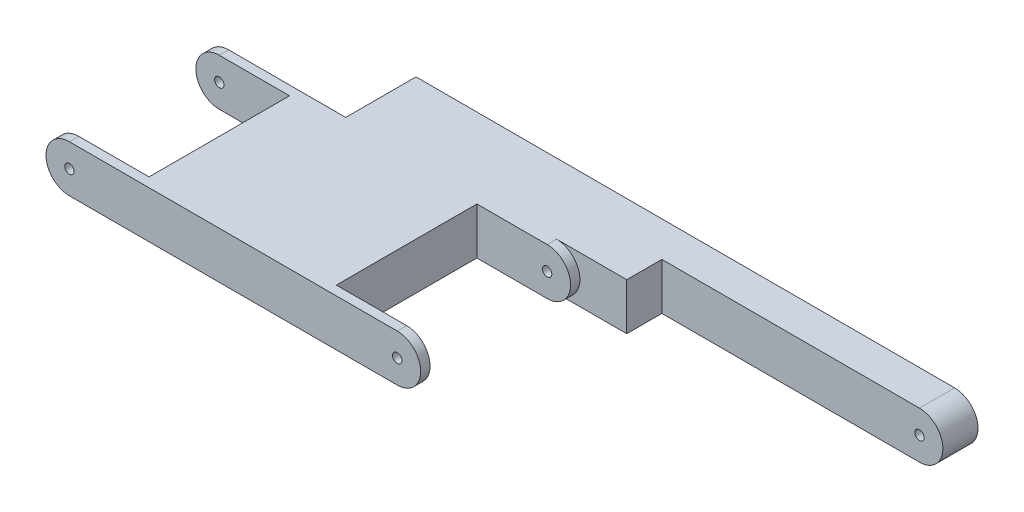
ISO-10303-21;
HEADER;
FILE_DESCRIPTION(('STEP AP214'),'2;1');
FILE_NAME('part.step','',(''),(''),'','','');
FILE_SCHEMA(('AUTOMOTIVE_DESIGN { 1 0 10303 214 1 1 1 1 }'));
ENDSEC;
DATA;
#1=APPLICATION_CONTEXT('core data for automotive mechanical design processes');
#2=APPLICATION_PROTOCOL_DEFINITION('international standard','automotive_design',2000,#1);
#3=PRODUCT_CONTEXT('',#1,'mechanical');
#4=PRODUCT('Part','Part','',(#3));
#5=PRODUCT_RELATED_PRODUCT_CATEGORY('part','',(#4));
#6=PRODUCT_DEFINITION_FORMATION('','',#4);
#7=PRODUCT_DEFINITION_CONTEXT('part definition',#1,'design');
#8=PRODUCT_DEFINITION('design','',#6,#7);
#9=PRODUCT_DEFINITION_SHAPE('','',#8);
#10=(LENGTH_UNIT() NAMED_UNIT(*) SI_UNIT(.MILLI.,.METRE.));
#11=(NAMED_UNIT(*) PLANE_ANGLE_UNIT() SI_UNIT($,.RADIAN.));
#12=(NAMED_UNIT(*) SI_UNIT($,.STERADIAN.) SOLID_ANGLE_UNIT());
#13=UNCERTAINTY_MEASURE_WITH_UNIT(LENGTH_MEASURE(1.E-05),#10,'distance_accuracy_value','');
#14=(GEOMETRIC_REPRESENTATION_CONTEXT(3) GLOBAL_UNCERTAINTY_ASSIGNED_CONTEXT((#13)) GLOBAL_UNIT_ASSIGNED_CONTEXT((#10,
#11,#12)) REPRESENTATION_CONTEXT('',''));
#15=CARTESIAN_POINT('',(0.,0.,0.));
#16=DIRECTION('',(0.,0.,1.));
#17=DIRECTION('',(1.,0.,0.));
#18=AXIS2_PLACEMENT_3D('',#15,#16,#17);
#19=CARTESIAN_POINT('',(105.,0.,0.));
#20=DIRECTION('',(0.,0.,1.));
#21=DIRECTION('',(1.,0.,0.));
#22=AXIS2_PLACEMENT_3D('',#19,#20,#21);
#23=PLANE('',#22);
#24=DIRECTION('',(1.,0.,0.));
#25=VECTOR('',#24,1.);
#26=CARTESIAN_POINT('',(0.,-5.,0.));
#27=LINE('',#26,#25);
#28=CARTESIAN_POINT('',(35.,-5.,0.));
#29=VERTEX_POINT('',#28);
#30=CARTESIAN_POINT('',(50.,-5.,0.));
#31=VERTEX_POINT('',#30);
#32=EDGE_CURVE('E183',#29,#31,#27,.T.);
#33=ORIENTED_EDGE('',*,*,#32,.T.);
#34=DIRECTION('',(0.,1.,0.));
#35=VECTOR('',#34,1.);
#36=CARTESIAN_POINT('',(50.,0.,0.));
#37=LINE('',#36,#35);
#38=CARTESIAN_POINT('',(50.,5.,0.));
#39=VERTEX_POINT('',#38);
#40=EDGE_CURVE('E314',#31,#39,#37,.T.);
#41=ORIENTED_EDGE('',*,*,#40,.T.);
#42=DIRECTION('',(-1.,0.,0.));
#43=VECTOR('',#42,1.);
#44=CARTESIAN_POINT('',(0.,5.,0.));
#45=LINE('',#44,#43);
#46=CARTESIAN_POINT('',(35.,5.,0.));
#47=VERTEX_POINT('',#46);
#48=EDGE_CURVE('E176',#39,#47,#45,.T.);
#49=ORIENTED_EDGE('',*,*,#48,.T.);
#50=CARTESIAN_POINT('',(35.,0.,0.));
#51=DIRECTION('',(0.,0.,1.));
#52=DIRECTION('',(1.,0.,0.));
#53=AXIS2_PLACEMENT_3D('',#50,#51,#52);
#54=CIRCLE('',#53,5.);
#55=EDGE_CURVE('E278',#29,#47,#54,.T.);
#56=ORIENTED_EDGE('',*,*,#55,.F.);
#57=EDGE_LOOP('',(#33,#41,#49,#56));
#58=FACE_BOUND('',#57,.T.);
#59=ADVANCED_FACE('F33',(#58),#23,.T.);
#60=CARTESIAN_POINT('',(-35.,-5.,34.));
#61=DIRECTION('',(0.,1.,0.));
#62=DIRECTION('',(0.,0.,1.));
#63=AXIS2_PLACEMENT_3D('',#60,#61,#62);
#64=PLANE('',#63);
#65=DIRECTION('',(0.,0.,-1.));
#66=VECTOR('',#65,1.);
#67=CARTESIAN_POINT('',(50.,-5.,34.));
#68=LINE('',#67,#66);
#69=CARTESIAN_POINT('',(50.,-5.,-7.5));
#70=VERTEX_POINT('',#69);
#71=EDGE_CURVE('E170',#31,#70,#68,.T.);
#72=ORIENTED_EDGE('',*,*,#71,.F.);
#73=ORIENTED_EDGE('',*,*,#32,.F.);
#74=DIRECTION('',(0.,0.,-1.));
#75=VECTOR('',#74,1.);
#76=CARTESIAN_POINT('',(35.,-5.,34.));
#77=LINE('',#76,#75);
#78=CARTESIAN_POINT('',(35.,-5.,2.));
#79=VERTEX_POINT('',#78);
#80=EDGE_CURVE('E289',#79,#29,#77,.T.);
#81=ORIENTED_EDGE('',*,*,#80,.F.);
#82=DIRECTION('',(1.,0.,0.));
#83=VECTOR('',#82,1.);
#84=CARTESIAN_POINT('',(-35.,-5.,2.));
#85=LINE('',#84,#83);
#86=CARTESIAN_POINT('',(20.,-5.,2.));
#87=VERTEX_POINT('',#86);
#88=EDGE_CURVE('E221',#87,#79,#85,.T.);
#89=ORIENTED_EDGE('',*,*,#88,.F.);
#90=DIRECTION('',(0.,0.,-1.));
#91=VECTOR('',#90,1.);
#92=CARTESIAN_POINT('',(20.,-5.,34.));
#93=LINE('',#92,#91);
#94=CARTESIAN_POINT('',(20.,-5.,32.));
#95=VERTEX_POINT('',#94);
#96=EDGE_CURVE('E223',#95,#87,#93,.T.);
#97=ORIENTED_EDGE('',*,*,#96,.F.);
#98=DIRECTION('',(-1.,0.,0.));
#99=VECTOR('',#98,1.);
#100=CARTESIAN_POINT('',(-35.,-5.,32.));
#101=LINE('',#100,#99);
#102=CARTESIAN_POINT('',(35.,-5.,32.));
#103=VERTEX_POINT('',#102);
#104=EDGE_CURVE('E214',#103,#95,#101,.T.);
#105=ORIENTED_EDGE('',*,*,#104,.F.);
#106=CARTESIAN_POINT('',(35.,-5.,34.));
#107=VERTEX_POINT('',#106);
#108=EDGE_CURVE('E290',#107,#103,#77,.T.);
#109=ORIENTED_EDGE('',*,*,#108,.F.);
#110=DIRECTION('',(1.,0.,0.));
#111=VECTOR('',#110,1.);
#112=CARTESIAN_POINT('',(-35.,-5.,34.));
#113=LINE('',#112,#111);
#114=CARTESIAN_POINT('',(-35.,-5.,34.));
#115=VERTEX_POINT('',#114);
#116=EDGE_CURVE('E258',#115,#107,#113,.T.);
#117=ORIENTED_EDGE('',*,*,#116,.F.);
#118=DIRECTION('',(0.,0.,-1.));
#119=VECTOR('',#118,1.);
#120=CARTESIAN_POINT('',(-35.,-5.,34.));
#121=LINE('',#120,#119);
#122=CARTESIAN_POINT('',(-35.,-5.,32.));
#123=VERTEX_POINT('',#122);
#124=EDGE_CURVE('E294',#115,#123,#121,.T.);
#125=ORIENTED_EDGE('',*,*,#124,.T.);
#126=DIRECTION('',(-1.,0.,0.));
#127=VECTOR('',#126,1.);
#128=CARTESIAN_POINT('',(-35.,-5.,32.));
#129=LINE('',#128,#127);
#130=CARTESIAN_POINT('',(-20.,-5.,32.));
#131=VERTEX_POINT('',#130);
#132=EDGE_CURVE('E244',#131,#123,#129,.T.);
#133=ORIENTED_EDGE('',*,*,#132,.F.);
#134=DIRECTION('',(0.,0.,1.));
#135=VECTOR('',#134,1.);
#136=CARTESIAN_POINT('',(-20.,-5.,34.));
#137=LINE('',#136,#135);
#138=CARTESIAN_POINT('',(-20.,-5.,2.));
#139=VERTEX_POINT('',#138);
#140=EDGE_CURVE('E246',#139,#131,#137,.T.);
#141=ORIENTED_EDGE('',*,*,#140,.F.);
#142=DIRECTION('',(1.,0.,0.));
#143=VECTOR('',#142,1.);
#144=CARTESIAN_POINT('',(-35.,-5.,2.));
#145=LINE('',#144,#143);
#146=CARTESIAN_POINT('',(-35.,-5.,2.));
#147=VERTEX_POINT('',#146);
#148=EDGE_CURVE('E237',#147,#139,#145,.T.);
#149=ORIENTED_EDGE('',*,*,#148,.F.);
#150=CARTESIAN_POINT('',(-35.,-5.,0.));
#151=VERTEX_POINT('',#150);
#152=EDGE_CURVE('E293',#147,#151,#121,.T.);
#153=ORIENTED_EDGE('',*,*,#152,.T.);
#154=DIRECTION('',(1.,0.,0.));
#155=VECTOR('',#154,1.);
#156=CARTESIAN_POINT('',(-35.,-5.,0.));
#157=LINE('',#156,#155);
#158=CARTESIAN_POINT('',(-10.,-5.,0.));
#159=VERTEX_POINT('',#158);
#160=EDGE_CURVE('E269',#151,#159,#157,.T.);
#161=ORIENTED_EDGE('',*,*,#160,.T.);
#162=DIRECTION('',(0.,0.,-1.));
#163=VECTOR('',#162,1.);
#164=CARTESIAN_POINT('',(-10.,-5.,-15.));
#165=LINE('',#164,#163);
#166=CARTESIAN_POINT('',(-10.,-5.,-15.));
#167=VERTEX_POINT('',#166);
#168=EDGE_CURVE('E326',#159,#167,#165,.T.);
#169=ORIENTED_EDGE('',*,*,#168,.T.);
#170=DIRECTION('',(1.,0.,0.));
#171=VECTOR('',#170,1.);
#172=CARTESIAN_POINT('',(0.,-5.,-15.));
#173=LINE('',#172,#171);
#174=CARTESIAN_POINT('',(105.,-5.,-15.));
#175=VERTEX_POINT('',#174);
#176=EDGE_CURVE('E182',#167,#175,#173,.T.);
#177=ORIENTED_EDGE('',*,*,#176,.T.);
#178=DIRECTION('',(0.,0.,1.));
#179=VECTOR('',#178,1.);
#180=CARTESIAN_POINT('',(105.,-5.,-15.));
#181=LINE('',#180,#179);
#182=CARTESIAN_POINT('',(105.,-5.,-7.5));
#183=VERTEX_POINT('',#182);
#184=EDGE_CURVE('E201',#175,#183,#181,.T.);
#185=ORIENTED_EDGE('',*,*,#184,.T.);
#186=DIRECTION('',(1.,0.,0.));
#187=VECTOR('',#186,1.);
#188=CARTESIAN_POINT('',(-35.,-5.,-7.5));
#189=LINE('',#188,#187);
#190=EDGE_CURVE('E48',#70,#183,#189,.T.);
#191=ORIENTED_EDGE('',*,*,#190,.F.);
#192=EDGE_LOOP('',(#72,#73,#81,#89,#97,#105,#109,#117,#125,#133,#141,#149,#153,#161,#169,#177,
#185,#191));
#193=FACE_BOUND('',#192,.T.);
#194=ADVANCED_FACE('F311',(#193),#64,.F.);
#195=CARTESIAN_POINT('',(-35.,5.,34.));
#196=DIRECTION('',(0.,-1.,0.));
#197=DIRECTION('',(0.,0.,-1.));
#198=AXIS2_PLACEMENT_3D('',#195,#196,#197);
#199=PLANE('',#198);
#200=DIRECTION('',(0.,0.,1.));
#201=VECTOR('',#200,1.);
#202=CARTESIAN_POINT('',(50.,5.,34.));
#203=LINE('',#202,#201);
#204=CARTESIAN_POINT('',(50.,5.,-7.5));
#205=VERTEX_POINT('',#204);
#206=EDGE_CURVE('E11',#205,#39,#203,.T.);
#207=ORIENTED_EDGE('',*,*,#206,.F.);
#208=DIRECTION('',(-1.,0.,0.));
#209=VECTOR('',#208,1.);
#210=CARTESIAN_POINT('',(-35.,5.,-7.5));
#211=LINE('',#210,#209);
#212=CARTESIAN_POINT('',(105.,5.,-7.5));
#213=VERTEX_POINT('',#212);
#214=EDGE_CURVE('E157',#213,#205,#211,.T.);
#215=ORIENTED_EDGE('',*,*,#214,.F.);
#216=DIRECTION('',(0.,0.,1.));
#217=VECTOR('',#216,1.);
#218=CARTESIAN_POINT('',(105.,5.,-15.));
#219=LINE('',#218,#217);
#220=CARTESIAN_POINT('',(105.,5.,-15.));
#221=VERTEX_POINT('',#220);
#222=EDGE_CURVE('E198',#221,#213,#219,.T.);
#223=ORIENTED_EDGE('',*,*,#222,.F.);
#224=DIRECTION('',(-1.,0.,0.));
#225=VECTOR('',#224,1.);
#226=CARTESIAN_POINT('',(0.,5.,-15.));
#227=LINE('',#226,#225);
#228=CARTESIAN_POINT('',(-10.,5.,-15.));
#229=VERTEX_POINT('',#228);
#230=EDGE_CURVE('E203',#221,#229,#227,.T.);
#231=ORIENTED_EDGE('',*,*,#230,.T.);
#232=DIRECTION('',(0.,0.,1.));
#233=VECTOR('',#232,1.);
#234=CARTESIAN_POINT('',(-10.,5.,-15.));
#235=LINE('',#234,#233);
#236=CARTESIAN_POINT('',(-10.,5.,0.));
#237=VERTEX_POINT('',#236);
#238=EDGE_CURVE('E317',#229,#237,#235,.T.);
#239=ORIENTED_EDGE('',*,*,#238,.T.);
#240=DIRECTION('',(-1.,0.,0.));
#241=VECTOR('',#240,1.);
#242=CARTESIAN_POINT('',(-35.,5.,0.));
#243=LINE('',#242,#241);
#244=CARTESIAN_POINT('',(-35.,5.,0.));
#245=VERTEX_POINT('',#244);
#246=EDGE_CURVE('E259',#237,#245,#243,.T.);
#247=ORIENTED_EDGE('',*,*,#246,.T.);
#248=DIRECTION('',(0.,0.,-1.));
#249=VECTOR('',#248,1.);
#250=CARTESIAN_POINT('',(-35.,5.,34.));
#251=LINE('',#250,#249);
#252=CARTESIAN_POINT('',(-35.,5.,2.));
#253=VERTEX_POINT('',#252);
#254=EDGE_CURVE('E265',#253,#245,#251,.T.);
#255=ORIENTED_EDGE('',*,*,#254,.F.);
#256=DIRECTION('',(-1.,0.,0.));
#257=VECTOR('',#256,1.);
#258=CARTESIAN_POINT('',(-35.,5.,2.));
#259=LINE('',#258,#257);
#260=CARTESIAN_POINT('',(-20.,5.,2.));
#261=VERTEX_POINT('',#260);
#262=EDGE_CURVE('E232',#261,#253,#259,.T.);
#263=ORIENTED_EDGE('',*,*,#262,.F.);
#264=DIRECTION('',(0.,0.,-1.));
#265=VECTOR('',#264,1.);
#266=CARTESIAN_POINT('',(-20.,5.,34.));
#267=LINE('',#266,#265);
#268=CARTESIAN_POINT('',(-20.,5.,32.));
#269=VERTEX_POINT('',#268);
#270=EDGE_CURVE('E360',#269,#261,#267,.T.);
#271=ORIENTED_EDGE('',*,*,#270,.F.);
#272=DIRECTION('',(1.,0.,0.));
#273=VECTOR('',#272,1.);
#274=CARTESIAN_POINT('',(-35.,5.,32.));
#275=LINE('',#274,#273);
#276=CARTESIAN_POINT('',(-35.,5.,32.));
#277=VERTEX_POINT('',#276);
#278=EDGE_CURVE('E240',#277,#269,#275,.T.);
#279=ORIENTED_EDGE('',*,*,#278,.F.);
#280=CARTESIAN_POINT('',(-35.,5.,34.));
#281=VERTEX_POINT('',#280);
#282=EDGE_CURVE('E283',#281,#277,#251,.T.);
#283=ORIENTED_EDGE('',*,*,#282,.F.);
#284=DIRECTION('',(-1.,0.,0.));
#285=VECTOR('',#284,1.);
#286=CARTESIAN_POINT('',(-35.,5.,34.));
#287=LINE('',#286,#285);
#288=CARTESIAN_POINT('',(35.,5.,34.));
#289=VERTEX_POINT('',#288);
#290=EDGE_CURVE('E263',#289,#281,#287,.T.);
#291=ORIENTED_EDGE('',*,*,#290,.F.);
#292=DIRECTION('',(0.,0.,-1.));
#293=VECTOR('',#292,1.);
#294=CARTESIAN_POINT('',(35.,5.,34.));
#295=LINE('',#294,#293);
#296=CARTESIAN_POINT('',(35.,5.,32.));
#297=VERTEX_POINT('',#296);
#298=EDGE_CURVE('E282',#289,#297,#295,.T.);
#299=ORIENTED_EDGE('',*,*,#298,.T.);
#300=DIRECTION('',(1.,0.,0.));
#301=VECTOR('',#300,1.);
#302=CARTESIAN_POINT('',(-35.,5.,32.));
#303=LINE('',#302,#301);
#304=CARTESIAN_POINT('',(20.,5.,32.));
#305=VERTEX_POINT('',#304);
#306=EDGE_CURVE('E212',#305,#297,#303,.T.);
#307=ORIENTED_EDGE('',*,*,#306,.F.);
#308=DIRECTION('',(0.,0.,1.));
#309=VECTOR('',#308,1.);
#310=CARTESIAN_POINT('',(20.,5.,34.));
#311=LINE('',#310,#309);
#312=CARTESIAN_POINT('',(20.,5.,2.));
#313=VERTEX_POINT('',#312);
#314=EDGE_CURVE('E41',#313,#305,#311,.T.);
#315=ORIENTED_EDGE('',*,*,#314,.F.);
#316=DIRECTION('',(-1.,0.,0.));
#317=VECTOR('',#316,1.);
#318=CARTESIAN_POINT('',(-35.,5.,2.));
#319=LINE('',#318,#317);
#320=CARTESIAN_POINT('',(35.,5.,2.));
#321=VERTEX_POINT('',#320);
#322=EDGE_CURVE('E219',#321,#313,#319,.T.);
#323=ORIENTED_EDGE('',*,*,#322,.F.);
#324=EDGE_CURVE('E179',#321,#47,#295,.T.);
#325=ORIENTED_EDGE('',*,*,#324,.T.);
#326=ORIENTED_EDGE('',*,*,#48,.F.);
#327=EDGE_LOOP('',(#207,#215,#223,#231,#239,#247,#255,#263,#271,#279,#283,#291,#299,#307,#315,
#323,#325,#326));
#328=FACE_BOUND('',#327,.T.);
#329=ADVANCED_FACE('F174',(#328),#199,.F.);
#330=CARTESIAN_POINT('',(105.,0.,-15.));
#331=DIRECTION('',(0.,0.,1.));
#332=DIRECTION('',(1.,0.,0.));
#333=AXIS2_PLACEMENT_3D('',#330,#331,#332);
#334=CYLINDRICAL_SURFACE('',#333,5.);
#335=ORIENTED_EDGE('',*,*,#222,.T.);
#336=CARTESIAN_POINT('',(105.,0.,-7.5));
#337=DIRECTION('',(0.,0.,1.));
#338=DIRECTION('',(1.,0.,0.));
#339=AXIS2_PLACEMENT_3D('',#336,#337,#338);
#340=CIRCLE('',#339,5.);
#341=EDGE_CURVE('E161',#213,#183,#340,.F.);
#342=ORIENTED_EDGE('',*,*,#341,.T.);
#343=ORIENTED_EDGE('',*,*,#184,.F.);
#344=CARTESIAN_POINT('',(105.,0.,-15.));
#345=DIRECTION('',(0.,0.,1.));
#346=DIRECTION('',(1.,0.,0.));
#347=AXIS2_PLACEMENT_3D('',#344,#345,#346);
#348=CIRCLE('',#347,5.);
#349=EDGE_CURVE('E185',#175,#221,#348,.T.);
#350=ORIENTED_EDGE('',*,*,#349,.T.);
#351=EDGE_LOOP('',(#335,#342,#343,#350));
#352=FACE_BOUND('',#351,.T.);
#353=ADVANCED_FACE('F428',(#352),#334,.T.);
#354=CARTESIAN_POINT('',(105.,0.,-15.000025));
#355=DIRECTION('',(0.,0.,1.));
#356=DIRECTION('',(1.,0.,0.));
#357=AXIS2_PLACEMENT_3D('',#354,#355,#356);
#358=CYLINDRICAL_SURFACE('',#357,0.999999999999998);
#359=CARTESIAN_POINT('',(105.,0.,-15.));
#360=DIRECTION('',(0.,0.,1.));
#361=DIRECTION('',(1.,0.,0.));
#362=AXIS2_PLACEMENT_3D('',#359,#360,#361);
#363=CIRCLE('',#362,0.999999999999998);
#364=CARTESIAN_POINT('',(106.,0.,-15.));
#365=VERTEX_POINT('',#364);
#366=EDGE_CURVE('E299',#365,#365,#363,.F.);
#367=ORIENTED_EDGE('',*,*,#366,.T.);
#368=EDGE_LOOP('',(#367));
#369=FACE_BOUND('',#368,.T.);
#370=CARTESIAN_POINT('',(105.,0.,-7.5));
#371=DIRECTION('',(0.,0.,1.));
#372=DIRECTION('',(1.,0.,0.));
#373=AXIS2_PLACEMENT_3D('',#370,#371,#372);
#374=CIRCLE('',#373,0.999999999999998);
#375=CARTESIAN_POINT('',(106.,0.,-7.5));
#376=VERTEX_POINT('',#375);
#377=EDGE_CURVE('E171',#376,#376,#374,.T.);
#378=ORIENTED_EDGE('',*,*,#377,.T.);
#379=EDGE_LOOP('',(#378));
#380=FACE_BOUND('',#379,.T.);
#381=ADVANCED_FACE('F430',(#369,#380),#358,.F.);
#382=CARTESIAN_POINT('',(105.,0.,-15.));
#383=DIRECTION('',(0.,0.,1.));
#384=DIRECTION('',(1.,0.,0.));
#385=AXIS2_PLACEMENT_3D('',#382,#383,#384);
#386=PLANE('',#385);
#387=ORIENTED_EDGE('',*,*,#176,.F.);
#388=DIRECTION('',(0.,1.,0.));
#389=VECTOR('',#388,1.);
#390=CARTESIAN_POINT('',(-10.,5.,-15.));
#391=LINE('',#390,#389);
#392=EDGE_CURVE('E313',#167,#229,#391,.T.);
#393=ORIENTED_EDGE('',*,*,#392,.T.);
#394=ORIENTED_EDGE('',*,*,#230,.F.);
#395=ORIENTED_EDGE('',*,*,#349,.F.);
#396=EDGE_LOOP('',(#387,#393,#394,#395));
#397=FACE_BOUND('',#396,.T.);
#398=CARTESIAN_POINT('',(35.,0.,-15.));
#399=DIRECTION('',(0.,0.,1.));
#400=DIRECTION('',(1.,0.,0.));
#401=AXIS2_PLACEMENT_3D('',#398,#399,#400);
#402=CIRCLE('',#401,0.999999999999998);
#403=CARTESIAN_POINT('',(36.,0.,-15.));
#404=VERTEX_POINT('',#403);
#405=EDGE_CURVE('E188',#404,#404,#402,.T.);
#406=ORIENTED_EDGE('',*,*,#405,.T.);
#407=EDGE_LOOP('',(#406));
#408=FACE_BOUND('',#407,.T.);
#409=ORIENTED_EDGE('',*,*,#366,.F.);
#410=EDGE_LOOP('',(#409));
#411=FACE_BOUND('',#410,.T.);
#412=ADVANCED_FACE('F339',(#397,#408,#411),#386,.F.);
#413=CARTESIAN_POINT('',(35.,0.,34.));
#414=DIRECTION('',(0.,0.,-1.));
#415=DIRECTION('',(-1.,0.,0.));
#416=AXIS2_PLACEMENT_3D('',#413,#414,#415);
#417=CYLINDRICAL_SURFACE('',#416,5.);
#418=ORIENTED_EDGE('',*,*,#324,.F.);
#419=CARTESIAN_POINT('',(35.,0.,2.));
#420=DIRECTION('',(0.,0.,1.));
#421=DIRECTION('',(1.,0.,0.));
#422=AXIS2_PLACEMENT_3D('',#419,#420,#421);
#423=CIRCLE('',#422,5.);
#424=EDGE_CURVE('E217',#79,#321,#423,.T.);
#425=ORIENTED_EDGE('',*,*,#424,.F.);
#426=ORIENTED_EDGE('',*,*,#80,.T.);
#427=ORIENTED_EDGE('',*,*,#55,.T.);
#428=EDGE_LOOP('',(#418,#425,#426,#427));
#429=FACE_BOUND('',#428,.T.);
#430=ADVANCED_FACE('F306',(#429),#417,.T.);
#431=CARTESIAN_POINT('',(35.,0.,32.));
#432=DIRECTION('',(0.,0.,-1.));
#433=DIRECTION('',(-1.,0.,0.));
#434=AXIS2_PLACEMENT_3D('',#431,#432,#433);
#435=CIRCLE('',#434,5.);
#436=EDGE_CURVE('E56',#297,#103,#435,.T.);
#437=ORIENTED_EDGE('',*,*,#436,.F.);
#438=ORIENTED_EDGE('',*,*,#298,.F.);
#439=CARTESIAN_POINT('',(35.,0.,34.));
#440=DIRECTION('',(0.,0.,1.));
#441=DIRECTION('',(1.,0.,0.));
#442=AXIS2_PLACEMENT_3D('',#439,#440,#441);
#443=CIRCLE('',#442,5.);
#444=EDGE_CURVE('E261',#107,#289,#443,.T.);
#445=ORIENTED_EDGE('',*,*,#444,.F.);
#446=ORIENTED_EDGE('',*,*,#108,.T.);
#447=EDGE_LOOP('',(#437,#438,#445,#446));
#448=FACE_BOUND('',#447,.T.);
#449=ADVANCED_FACE('F396',(#448),#417,.T.);
#450=CARTESIAN_POINT('',(35.,0.,34.));
#451=DIRECTION('',(0.,0.,-1.));
#452=DIRECTION('',(-1.,0.,0.));
#453=AXIS2_PLACEMENT_3D('',#450,#451,#452);
#454=CYLINDRICAL_SURFACE('',#453,0.999999999999998);
#455=CARTESIAN_POINT('',(35.,0.,2.));
#456=DIRECTION('',(0.,0.,1.));
#457=DIRECTION('',(1.,0.,0.));
#458=AXIS2_PLACEMENT_3D('',#455,#456,#457);
#459=CIRCLE('',#458,0.999999999999998);
#460=CARTESIAN_POINT('',(36.,0.,2.));
#461=VERTEX_POINT('',#460);
#462=EDGE_CURVE('E216',#461,#461,#459,.T.);
#463=ORIENTED_EDGE('',*,*,#462,.T.);
#464=EDGE_LOOP('',(#463));
#465=FACE_BOUND('',#464,.T.);
#466=ORIENTED_EDGE('',*,*,#405,.F.);
#467=EDGE_LOOP('',(#466));
#468=FACE_BOUND('',#467,.T.);
#469=ADVANCED_FACE('F378',(#465,#468),#454,.F.);
#470=CARTESIAN_POINT('',(35.,0.,34.));
#471=DIRECTION('',(0.,0.,1.));
#472=DIRECTION('',(-1.,0.,0.));
#473=AXIS2_PLACEMENT_3D('',#470,#471,#472);
#474=CIRCLE('',#473,0.999999999999998);
#475=CARTESIAN_POINT('',(34.,0.,34.));
#476=VERTEX_POINT('',#475);
#477=EDGE_CURVE('E248',#476,#476,#474,.T.);
#478=ORIENTED_EDGE('',*,*,#477,.T.);
#479=EDGE_LOOP('',(#478));
#480=FACE_BOUND('',#479,.T.);
#481=CARTESIAN_POINT('',(35.,0.,32.));
#482=DIRECTION('',(0.,0.,-1.));
#483=DIRECTION('',(-1.,0.,0.));
#484=AXIS2_PLACEMENT_3D('',#481,#482,#483);
#485=CIRCLE('',#484,0.999999999999998);
#486=CARTESIAN_POINT('',(34.,0.,32.));
#487=VERTEX_POINT('',#486);
#488=EDGE_CURVE('E210',#487,#487,#485,.T.);
#489=ORIENTED_EDGE('',*,*,#488,.T.);
#490=EDGE_LOOP('',(#489));
#491=FACE_BOUND('',#490,.T.);
#492=ADVANCED_FACE('F406',(#480,#491),#454,.F.);
#493=CARTESIAN_POINT('',(-35.,0.,34.));
#494=DIRECTION('',(0.,0.,-1.));
#495=DIRECTION('',(-1.,0.,0.));
#496=AXIS2_PLACEMENT_3D('',#493,#494,#495);
#497=CYLINDRICAL_SURFACE('',#496,5.);
#498=ORIENTED_EDGE('',*,*,#282,.T.);
#499=CARTESIAN_POINT('',(-35.,0.,32.));
#500=DIRECTION('',(0.,0.,-1.));
#501=DIRECTION('',(-1.,0.,0.));
#502=AXIS2_PLACEMENT_3D('',#499,#500,#501);
#503=CIRCLE('',#502,5.);
#504=EDGE_CURVE('E242',#123,#277,#503,.T.);
#505=ORIENTED_EDGE('',*,*,#504,.F.);
#506=ORIENTED_EDGE('',*,*,#124,.F.);
#507=CARTESIAN_POINT('',(-35.,0.,34.));
#508=DIRECTION('',(0.,0.,1.));
#509=DIRECTION('',(1.,0.,0.));
#510=AXIS2_PLACEMENT_3D('',#507,#508,#509);
#511=CIRCLE('',#510,5.);
#512=EDGE_CURVE('E255',#281,#115,#511,.T.);
#513=ORIENTED_EDGE('',*,*,#512,.F.);
#514=EDGE_LOOP('',(#498,#505,#506,#513));
#515=FACE_BOUND('',#514,.T.);
#516=ADVANCED_FACE('F35',(#515),#497,.T.);
#517=CARTESIAN_POINT('',(-35.,0.,2.));
#518=DIRECTION('',(0.,0.,1.));
#519=DIRECTION('',(1.,0.,0.));
#520=AXIS2_PLACEMENT_3D('',#517,#518,#519);
#521=CIRCLE('',#520,5.);
#522=EDGE_CURVE('E235',#253,#147,#521,.T.);
#523=ORIENTED_EDGE('',*,*,#522,.F.);
#524=ORIENTED_EDGE('',*,*,#254,.T.);
#525=CARTESIAN_POINT('',(-35.,0.,0.));
#526=DIRECTION('',(0.,0.,1.));
#527=DIRECTION('',(1.,0.,0.));
#528=AXIS2_PLACEMENT_3D('',#525,#526,#527);
#529=CIRCLE('',#528,5.);
#530=EDGE_CURVE('E266',#245,#151,#529,.T.);
#531=ORIENTED_EDGE('',*,*,#530,.T.);
#532=ORIENTED_EDGE('',*,*,#152,.F.);
#533=EDGE_LOOP('',(#523,#524,#531,#532));
#534=FACE_BOUND('',#533,.T.);
#535=ADVANCED_FACE('F347',(#534),#497,.T.);
#536=CARTESIAN_POINT('',(-35.,0.,34.));
#537=DIRECTION('',(0.,0.,-1.));
#538=DIRECTION('',(-1.,0.,0.));
#539=AXIS2_PLACEMENT_3D('',#536,#537,#538);
#540=CYLINDRICAL_SURFACE('',#539,0.999999999999998);
#541=CARTESIAN_POINT('',(-35.,0.,34.));
#542=DIRECTION('',(0.,0.,1.));
#543=DIRECTION('',(1.,0.,0.));
#544=AXIS2_PLACEMENT_3D('',#541,#542,#543);
#545=CIRCLE('',#544,0.999999999999998);
#546=CARTESIAN_POINT('',(-34.,0.,34.));
#547=VERTEX_POINT('',#546);
#548=EDGE_CURVE('E251',#547,#547,#545,.T.);
#549=ORIENTED_EDGE('',*,*,#548,.T.);
#550=EDGE_LOOP('',(#549));
#551=FACE_BOUND('',#550,.T.);
#552=CARTESIAN_POINT('',(-35.,0.,32.));
#553=DIRECTION('',(0.,0.,-1.));
#554=DIRECTION('',(-1.,0.,0.));
#555=AXIS2_PLACEMENT_3D('',#552,#553,#554);
#556=CIRCLE('',#555,0.999999999999998);
#557=CARTESIAN_POINT('',(-36.,0.,32.));
#558=VERTEX_POINT('',#557);
#559=EDGE_CURVE('E239',#558,#558,#556,.T.);
#560=ORIENTED_EDGE('',*,*,#559,.T.);
#561=EDGE_LOOP('',(#560));
#562=FACE_BOUND('',#561,.T.);
#563=ADVANCED_FACE('F570',(#551,#562),#540,.F.);
#564=CARTESIAN_POINT('',(-35.,0.,0.));
#565=DIRECTION('',(0.,0.,1.));
#566=DIRECTION('',(1.,0.,0.));
#567=AXIS2_PLACEMENT_3D('',#564,#565,#566);
#568=CIRCLE('',#567,0.999999999999998);
#569=CARTESIAN_POINT('',(-34.,0.,0.));
#570=VERTEX_POINT('',#569);
#571=EDGE_CURVE('E254',#570,#570,#568,.F.);
#572=ORIENTED_EDGE('',*,*,#571,.T.);
#573=EDGE_LOOP('',(#572));
#574=FACE_BOUND('',#573,.T.);
#575=CARTESIAN_POINT('',(-35.,0.,2.));
#576=DIRECTION('',(0.,0.,1.));
#577=DIRECTION('',(1.,0.,0.));
#578=AXIS2_PLACEMENT_3D('',#575,#576,#577);
#579=CIRCLE('',#578,0.999999999999998);
#580=CARTESIAN_POINT('',(-34.,0.,2.));
#581=VERTEX_POINT('',#580);
#582=EDGE_CURVE('E231',#581,#581,#579,.T.);
#583=ORIENTED_EDGE('',*,*,#582,.T.);
#584=EDGE_LOOP('',(#583));
#585=FACE_BOUND('',#584,.T.);
#586=ADVANCED_FACE('F401',(#574,#585),#540,.F.);
#587=CARTESIAN_POINT('',(-35.,0.,34.));
#588=DIRECTION('',(0.,0.,1.));
#589=DIRECTION('',(1.,0.,0.));
#590=AXIS2_PLACEMENT_3D('',#587,#588,#589);
#591=PLANE('',#590);
#592=ORIENTED_EDGE('',*,*,#548,.F.);
#593=EDGE_LOOP('',(#592));
#594=FACE_BOUND('',#593,.T.);
#595=ORIENTED_EDGE('',*,*,#512,.T.);
#596=ORIENTED_EDGE('',*,*,#116,.T.);
#597=ORIENTED_EDGE('',*,*,#444,.T.);
#598=ORIENTED_EDGE('',*,*,#290,.T.);
#599=EDGE_LOOP('',(#595,#596,#597,#598));
#600=FACE_BOUND('',#599,.T.);
#601=ORIENTED_EDGE('',*,*,#477,.F.);
#602=EDGE_LOOP('',(#601));
#603=FACE_BOUND('',#602,.T.);
#604=ADVANCED_FACE('F398',(#594,#600,#603),#591,.T.);
#605=CARTESIAN_POINT('',(-35.,0.,0.));
#606=DIRECTION('',(0.,0.,1.));
#607=DIRECTION('',(1.,0.,0.));
#608=AXIS2_PLACEMENT_3D('',#605,#606,#607);
#609=PLANE('',#608);
#610=ORIENTED_EDGE('',*,*,#571,.F.);
#611=EDGE_LOOP('',(#610));
#612=FACE_BOUND('',#611,.T.);
#613=ORIENTED_EDGE('',*,*,#246,.F.);
#614=DIRECTION('',(0.,-1.,0.));
#615=VECTOR('',#614,1.);
#616=CARTESIAN_POINT('',(-10.,5.,0.));
#617=LINE('',#616,#615);
#618=EDGE_CURVE('E323',#237,#159,#617,.T.);
#619=ORIENTED_EDGE('',*,*,#618,.T.);
#620=ORIENTED_EDGE('',*,*,#160,.F.);
#621=ORIENTED_EDGE('',*,*,#530,.F.);
#622=EDGE_LOOP('',(#613,#619,#620,#621));
#623=FACE_BOUND('',#622,.T.);
#624=ADVANCED_FACE('F343',(#612,#623),#609,.F.);
#625=CARTESIAN_POINT('',(-20.,30.,2.));
#626=DIRECTION('',(-1.,0.,0.));
#627=DIRECTION('',(0.,0.,1.));
#628=AXIS2_PLACEMENT_3D('',#625,#626,#627);
#629=PLANE('',#628);
#630=ORIENTED_EDGE('',*,*,#140,.T.);
#631=DIRECTION('',(0.,-1.,0.));
#632=VECTOR('',#631,1.);
#633=CARTESIAN_POINT('',(-20.,30.,32.));
#634=LINE('',#633,#632);
#635=EDGE_CURVE('E228',#269,#131,#634,.T.);
#636=ORIENTED_EDGE('',*,*,#635,.F.);
#637=ORIENTED_EDGE('',*,*,#270,.T.);
#638=DIRECTION('',(0.,-1.,0.));
#639=VECTOR('',#638,1.);
#640=CARTESIAN_POINT('',(-20.,30.,2.));
#641=LINE('',#640,#639);
#642=EDGE_CURVE('E225',#261,#139,#641,.T.);
#643=ORIENTED_EDGE('',*,*,#642,.T.);
#644=EDGE_LOOP('',(#630,#636,#637,#643));
#645=FACE_BOUND('',#644,.T.);
#646=ADVANCED_FACE('F366',(#645),#629,.T.);
#647=CARTESIAN_POINT('',(-40.,30.,32.));
#648=DIRECTION('',(0.,0.,-1.));
#649=DIRECTION('',(-1.,0.,0.));
#650=AXIS2_PLACEMENT_3D('',#647,#648,#649);
#651=PLANE('',#650);
#652=ORIENTED_EDGE('',*,*,#559,.F.);
#653=EDGE_LOOP('',(#652));
#654=FACE_BOUND('',#653,.T.);
#655=ORIENTED_EDGE('',*,*,#132,.T.);
#656=ORIENTED_EDGE('',*,*,#504,.T.);
#657=ORIENTED_EDGE('',*,*,#278,.T.);
#658=ORIENTED_EDGE('',*,*,#635,.T.);
#659=EDGE_LOOP('',(#655,#656,#657,#658));
#660=FACE_BOUND('',#659,.T.);
#661=ADVANCED_FACE('F363',(#654,#660),#651,.T.);
#662=CARTESIAN_POINT('',(-40.,30.,2.));
#663=DIRECTION('',(0.,0.,1.));
#664=DIRECTION('',(1.,0.,0.));
#665=AXIS2_PLACEMENT_3D('',#662,#663,#664);
#666=PLANE('',#665);
#667=ORIENTED_EDGE('',*,*,#582,.F.);
#668=EDGE_LOOP('',(#667));
#669=FACE_BOUND('',#668,.T.);
#670=ORIENTED_EDGE('',*,*,#148,.T.);
#671=ORIENTED_EDGE('',*,*,#642,.F.);
#672=ORIENTED_EDGE('',*,*,#262,.T.);
#673=ORIENTED_EDGE('',*,*,#522,.T.);
#674=EDGE_LOOP('',(#670,#671,#672,#673));
#675=FACE_BOUND('',#674,.T.);
#676=ADVANCED_FACE('F538',(#669,#675),#666,.T.);
#677=CARTESIAN_POINT('',(20.,30.,2.));
#678=DIRECTION('',(1.,0.,0.));
#679=DIRECTION('',(0.,0.,-1.));
#680=AXIS2_PLACEMENT_3D('',#677,#678,#679);
#681=PLANE('',#680);
#682=ORIENTED_EDGE('',*,*,#96,.T.);
#683=DIRECTION('',(0.,-1.,0.));
#684=VECTOR('',#683,1.);
#685=CARTESIAN_POINT('',(20.,30.,2.));
#686=LINE('',#685,#684);
#687=EDGE_CURVE('E207',#313,#87,#686,.T.);
#688=ORIENTED_EDGE('',*,*,#687,.F.);
#689=ORIENTED_EDGE('',*,*,#314,.T.);
#690=DIRECTION('',(0.,-1.,0.));
#691=VECTOR('',#690,1.);
#692=CARTESIAN_POINT('',(20.,30.,32.));
#693=LINE('',#692,#691);
#694=EDGE_CURVE('E200',#305,#95,#693,.T.);
#695=ORIENTED_EDGE('',*,*,#694,.T.);
#696=EDGE_LOOP('',(#682,#688,#689,#695));
#697=FACE_BOUND('',#696,.T.);
#698=ADVANCED_FACE('F385',(#697),#681,.T.);
#699=CARTESIAN_POINT('',(40.,30.,2.));
#700=DIRECTION('',(0.,0.,1.));
#701=DIRECTION('',(1.,0.,0.));
#702=AXIS2_PLACEMENT_3D('',#699,#700,#701);
#703=PLANE('',#702);
#704=ORIENTED_EDGE('',*,*,#462,.F.);
#705=EDGE_LOOP('',(#704));
#706=FACE_BOUND('',#705,.T.);
#707=ORIENTED_EDGE('',*,*,#88,.T.);
#708=ORIENTED_EDGE('',*,*,#424,.T.);
#709=ORIENTED_EDGE('',*,*,#322,.T.);
#710=ORIENTED_EDGE('',*,*,#687,.T.);
#711=EDGE_LOOP('',(#707,#708,#709,#710));
#712=FACE_BOUND('',#711,.T.);
#713=ADVANCED_FACE('F381',(#706,#712),#703,.T.);
#714=CARTESIAN_POINT('',(40.,30.,32.));
#715=DIRECTION('',(0.,0.,-1.));
#716=DIRECTION('',(-1.,0.,0.));
#717=AXIS2_PLACEMENT_3D('',#714,#715,#716);
#718=PLANE('',#717);
#719=ORIENTED_EDGE('',*,*,#488,.F.);
#720=EDGE_LOOP('',(#719));
#721=FACE_BOUND('',#720,.T.);
#722=ORIENTED_EDGE('',*,*,#104,.T.);
#723=ORIENTED_EDGE('',*,*,#694,.F.);
#724=ORIENTED_EDGE('',*,*,#306,.T.);
#725=ORIENTED_EDGE('',*,*,#436,.T.);
#726=EDGE_LOOP('',(#722,#723,#724,#725));
#727=FACE_BOUND('',#726,.T.);
#728=ADVANCED_FACE('F384',(#721,#727),#718,.T.);
#729=CARTESIAN_POINT('',(-10.,0.,0.));
#730=DIRECTION('',(-1.,0.,0.));
#731=DIRECTION('',(0.,0.,1.));
#732=AXIS2_PLACEMENT_3D('',#729,#730,#731);
#733=PLANE('',#732);
#734=ORIENTED_EDGE('',*,*,#392,.F.);
#735=ORIENTED_EDGE('',*,*,#168,.F.);
#736=ORIENTED_EDGE('',*,*,#618,.F.);
#737=ORIENTED_EDGE('',*,*,#238,.F.);
#738=EDGE_LOOP('',(#734,#735,#736,#737));
#739=FACE_BOUND('',#738,.T.);
#740=ADVANCED_FACE('F338',(#739),#733,.T.);
#741=CARTESIAN_POINT('',(50.,10.,-7.5));
#742=DIRECTION('',(1.,0.,0.));
#743=DIRECTION('',(0.,0.,-1.));
#744=AXIS2_PLACEMENT_3D('',#741,#742,#743);
#745=PLANE('',#744);
#746=ORIENTED_EDGE('',*,*,#71,.T.);
#747=DIRECTION('',(0.,-1.,0.));
#748=VECTOR('',#747,1.);
#749=CARTESIAN_POINT('',(50.,10.,-7.5));
#750=LINE('',#749,#748);
#751=EDGE_CURVE('E160',#205,#70,#750,.T.);
#752=ORIENTED_EDGE('',*,*,#751,.F.);
#753=ORIENTED_EDGE('',*,*,#206,.T.);
#754=ORIENTED_EDGE('',*,*,#40,.F.);
#755=EDGE_LOOP('',(#746,#752,#753,#754));
#756=FACE_BOUND('',#755,.T.);
#757=ADVANCED_FACE('F167',(#756),#745,.T.);
#758=CARTESIAN_POINT('',(50.,10.,-7.5));
#759=DIRECTION('',(0.,0.,1.));
#760=DIRECTION('',(1.,0.,0.));
#761=AXIS2_PLACEMENT_3D('',#758,#759,#760);
#762=PLANE('',#761);
#763=ORIENTED_EDGE('',*,*,#377,.F.);
#764=EDGE_LOOP('',(#763));
#765=FACE_BOUND('',#764,.T.);
#766=ORIENTED_EDGE('',*,*,#190,.T.);
#767=ORIENTED_EDGE('',*,*,#341,.F.);
#768=ORIENTED_EDGE('',*,*,#214,.T.);
#769=ORIENTED_EDGE('',*,*,#751,.T.);
#770=EDGE_LOOP('',(#766,#767,#768,#769));
#771=FACE_BOUND('',#770,.T.);
#772=ADVANCED_FACE('F159',(#765,#771),#762,.T.);
#773=CLOSED_SHELL('',(#59,#194,#329,#353,#381,#412,#430,#449,#469,#492,#516,#535,#563,#586,#604,
#624,#646,#661,#676,#698,#713,#728,#740,#757,#772));
#774=MANIFOLD_SOLID_BREP('B2',#773);
#775=ADVANCED_BREP_SHAPE_REPRESENTATION('',(#18,#774),#14);
#776=SHAPE_DEFINITION_REPRESENTATION(#9,#775);
ENDSEC;
END-ISO-10303-21;
